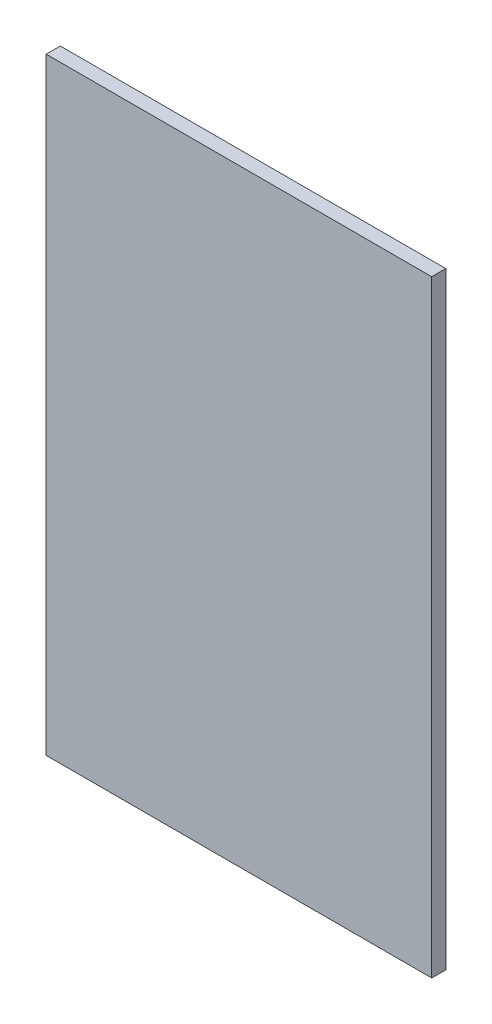
ISO-10303-21;
HEADER;
FILE_DESCRIPTION(('STEP AP214'),'2;1');
FILE_NAME('part.step','',(''),(''),'','','');
FILE_SCHEMA(('AUTOMOTIVE_DESIGN { 1 0 10303 214 1 1 1 1 }'));
ENDSEC;
DATA;
#1=APPLICATION_CONTEXT('core data for automotive mechanical design processes');
#2=APPLICATION_PROTOCOL_DEFINITION('international standard','automotive_design',2000,#1);
#3=PRODUCT_CONTEXT('',#1,'mechanical');
#4=PRODUCT('Part','Part','',(#3));
#5=PRODUCT_RELATED_PRODUCT_CATEGORY('part','',(#4));
#6=PRODUCT_DEFINITION_FORMATION('','',#4);
#7=PRODUCT_DEFINITION_CONTEXT('part definition',#1,'design');
#8=PRODUCT_DEFINITION('design','',#6,#7);
#9=PRODUCT_DEFINITION_SHAPE('','',#8);
#10=(LENGTH_UNIT() NAMED_UNIT(*) SI_UNIT(.MILLI.,.METRE.));
#11=(NAMED_UNIT(*) PLANE_ANGLE_UNIT() SI_UNIT($,.RADIAN.));
#12=(NAMED_UNIT(*) SI_UNIT($,.STERADIAN.) SOLID_ANGLE_UNIT());
#13=UNCERTAINTY_MEASURE_WITH_UNIT(LENGTH_MEASURE(1.E-05),#10,'distance_accuracy_value','');
#14=(GEOMETRIC_REPRESENTATION_CONTEXT(3) GLOBAL_UNCERTAINTY_ASSIGNED_CONTEXT((#13)) GLOBAL_UNIT_ASSIGNED_CONTEXT((#10,
#11,#12)) REPRESENTATION_CONTEXT('',''));
#15=CARTESIAN_POINT('',(0.,0.,0.));
#16=DIRECTION('',(0.,0.,1.));
#17=DIRECTION('',(1.,0.,0.));
#18=AXIS2_PLACEMENT_3D('',#15,#16,#17);
#19=CARTESIAN_POINT('',(64.0487804878048,77.3655520039216,3.));
#20=DIRECTION('',(1.,0.,0.));
#21=DIRECTION('',(0.,1.,0.));
#22=AXIS2_PLACEMENT_3D('',#19,#20,#21);
#23=PLANE('',#22);
#24=DIRECTION('',(0.,-1.,0.));
#25=VECTOR('',#24,1.);
#26=CARTESIAN_POINT('',(64.0487804878048,77.3655520039216,0.));
#27=LINE('',#26,#25);
#28=CARTESIAN_POINT('',(64.0487804878048,77.3655520039216,0.));
#29=VERTEX_POINT('',#28);
#30=CARTESIAN_POINT('',(64.0487804878048,-51.8048780487805,0.));
#31=VERTEX_POINT('',#30);
#32=EDGE_CURVE('E109',#29,#31,#27,.T.);
#33=ORIENTED_EDGE('',*,*,#32,.T.);
#34=DIRECTION('',(0.,0.,-1.));
#35=VECTOR('',#34,1.);
#36=CARTESIAN_POINT('',(64.0487804878048,-51.8048780487805,3.));
#37=LINE('',#36,#35);
#38=CARTESIAN_POINT('',(64.0487804878048,-51.8048780487805,3.));
#39=VERTEX_POINT('',#38);
#40=EDGE_CURVE('E11',#39,#31,#37,.T.);
#41=ORIENTED_EDGE('',*,*,#40,.F.);
#42=DIRECTION('',(0.,-1.,0.));
#43=VECTOR('',#42,1.);
#44=CARTESIAN_POINT('',(64.0487804878048,77.3655520039216,3.));
#45=LINE('',#44,#43);
#46=CARTESIAN_POINT('',(64.0487804878048,77.3655520039216,3.));
#47=VERTEX_POINT('',#46);
#48=EDGE_CURVE('E93',#47,#39,#45,.T.);
#49=ORIENTED_EDGE('',*,*,#48,.F.);
#50=DIRECTION('',(0.,0.,-1.));
#51=VECTOR('',#50,1.);
#52=CARTESIAN_POINT('',(64.0487804878048,77.3655520039216,3.));
#53=LINE('',#52,#51);
#54=EDGE_CURVE('E105',#47,#29,#53,.T.);
#55=ORIENTED_EDGE('',*,*,#54,.T.);
#56=EDGE_LOOP('',(#33,#41,#49,#55));
#57=FACE_BOUND('',#56,.T.);
#58=ADVANCED_FACE('F41',(#57),#23,.F.);
#59=CARTESIAN_POINT('',(64.0487804878048,-51.8048780487805,3.));
#60=DIRECTION('',(0.,1.,0.));
#61=DIRECTION('',(0.,0.,1.));
#62=AXIS2_PLACEMENT_3D('',#59,#60,#61);
#63=PLANE('',#62);
#64=DIRECTION('',(1.,0.,0.));
#65=VECTOR('',#64,1.);
#66=CARTESIAN_POINT('',(64.0487804878048,-51.8048780487805,0.));
#67=LINE('',#66,#65);
#68=CARTESIAN_POINT('',(146.048780487805,-51.8048780487805,0.));
#69=VERTEX_POINT('',#68);
#70=EDGE_CURVE('E98',#31,#69,#67,.T.);
#71=ORIENTED_EDGE('',*,*,#70,.T.);
#72=DIRECTION('',(0.,0.,-1.));
#73=VECTOR('',#72,1.);
#74=CARTESIAN_POINT('',(146.048780487805,-51.8048780487805,3.));
#75=LINE('',#74,#73);
#76=CARTESIAN_POINT('',(146.048780487805,-51.8048780487805,3.));
#77=VERTEX_POINT('',#76);
#78=EDGE_CURVE('E50',#77,#69,#75,.T.);
#79=ORIENTED_EDGE('',*,*,#78,.F.);
#80=DIRECTION('',(1.,0.,0.));
#81=VECTOR('',#80,1.);
#82=CARTESIAN_POINT('',(64.0487804878048,-51.8048780487805,3.));
#83=LINE('',#82,#81);
#84=EDGE_CURVE('E88',#39,#77,#83,.T.);
#85=ORIENTED_EDGE('',*,*,#84,.F.);
#86=ORIENTED_EDGE('',*,*,#40,.T.);
#87=EDGE_LOOP('',(#71,#79,#85,#86));
#88=FACE_BOUND('',#87,.T.);
#89=ADVANCED_FACE('F97',(#88),#63,.F.);
#90=CARTESIAN_POINT('',(146.048780487805,77.3655520039216,3.));
#91=DIRECTION('',(-1.,0.,0.));
#92=DIRECTION('',(0.,0.,1.));
#93=AXIS2_PLACEMENT_3D('',#90,#91,#92);
#94=PLANE('',#93);
#95=DIRECTION('',(0.,1.,0.));
#96=VECTOR('',#95,1.);
#97=CARTESIAN_POINT('',(146.048780487805,77.3655520039216,0.));
#98=LINE('',#97,#96);
#99=CARTESIAN_POINT('',(146.048780487805,77.3655520039216,0.));
#100=VERTEX_POINT('',#99);
#101=EDGE_CURVE('E75',#69,#100,#98,.T.);
#102=ORIENTED_EDGE('',*,*,#101,.T.);
#103=DIRECTION('',(0.,0.,-1.));
#104=VECTOR('',#103,1.);
#105=CARTESIAN_POINT('',(146.048780487805,77.3655520039216,3.));
#106=LINE('',#105,#104);
#107=CARTESIAN_POINT('',(146.048780487805,77.3655520039216,3.));
#108=VERTEX_POINT('',#107);
#109=EDGE_CURVE('E100',#108,#100,#106,.T.);
#110=ORIENTED_EDGE('',*,*,#109,.F.);
#111=DIRECTION('',(0.,1.,0.));
#112=VECTOR('',#111,1.);
#113=CARTESIAN_POINT('',(146.048780487805,77.3655520039216,3.));
#114=LINE('',#113,#112);
#115=EDGE_CURVE('E91',#77,#108,#114,.T.);
#116=ORIENTED_EDGE('',*,*,#115,.F.);
#117=ORIENTED_EDGE('',*,*,#78,.T.);
#118=EDGE_LOOP('',(#102,#110,#116,#117));
#119=FACE_BOUND('',#118,.T.);
#120=ADVANCED_FACE('F101',(#119),#94,.F.);
#121=CARTESIAN_POINT('',(64.0487804878048,77.3655520039216,3.));
#122=DIRECTION('',(0.,-1.,0.));
#123=DIRECTION('',(0.,0.,-1.));
#124=AXIS2_PLACEMENT_3D('',#121,#122,#123);
#125=PLANE('',#124);
#126=DIRECTION('',(-1.,0.,0.));
#127=VECTOR('',#126,1.);
#128=CARTESIAN_POINT('',(64.0487804878048,77.3655520039216,0.));
#129=LINE('',#128,#127);
#130=EDGE_CURVE('E81',#100,#29,#129,.T.);
#131=ORIENTED_EDGE('',*,*,#130,.T.);
#132=ORIENTED_EDGE('',*,*,#54,.F.);
#133=DIRECTION('',(-1.,0.,0.));
#134=VECTOR('',#133,1.);
#135=CARTESIAN_POINT('',(64.0487804878048,77.3655520039216,3.));
#136=LINE('',#135,#134);
#137=EDGE_CURVE('E58',#108,#47,#136,.T.);
#138=ORIENTED_EDGE('',*,*,#137,.F.);
#139=ORIENTED_EDGE('',*,*,#109,.T.);
#140=EDGE_LOOP('',(#131,#132,#138,#139));
#141=FACE_BOUND('',#140,.T.);
#142=ADVANCED_FACE('F122',(#141),#125,.F.);
#143=CARTESIAN_POINT('',(0.,0.,3.));
#144=DIRECTION('',(0.,0.,1.));
#145=DIRECTION('',(1.,0.,0.));
#146=AXIS2_PLACEMENT_3D('',#143,#144,#145);
#147=PLANE('',#146);
#148=ORIENTED_EDGE('',*,*,#48,.T.);
#149=ORIENTED_EDGE('',*,*,#84,.T.);
#150=ORIENTED_EDGE('',*,*,#115,.T.);
#151=ORIENTED_EDGE('',*,*,#137,.T.);
#152=EDGE_LOOP('',(#148,#149,#150,#151));
#153=FACE_BOUND('',#152,.T.);
#154=ADVANCED_FACE('F89',(#153),#147,.T.);
#155=CARTESIAN_POINT('',(0.,0.,0.));
#156=DIRECTION('',(0.,0.,1.));
#157=DIRECTION('',(1.,0.,0.));
#158=AXIS2_PLACEMENT_3D('',#155,#156,#157);
#159=PLANE('',#158);
#160=ORIENTED_EDGE('',*,*,#32,.F.);
#161=ORIENTED_EDGE('',*,*,#130,.F.);
#162=ORIENTED_EDGE('',*,*,#101,.F.);
#163=ORIENTED_EDGE('',*,*,#70,.F.);
#164=EDGE_LOOP('',(#160,#161,#162,#163));
#165=FACE_BOUND('',#164,.T.);
#166=ADVANCED_FACE('F125',(#165),#159,.F.);
#167=CLOSED_SHELL('',(#58,#89,#120,#142,#154,#166));
#168=MANIFOLD_SOLID_BREP('B2',#167);
#169=ADVANCED_BREP_SHAPE_REPRESENTATION('',(#18,#168),#14);
#170=SHAPE_DEFINITION_REPRESENTATION(#9,#169);
ENDSEC;
END-ISO-10303-21;
